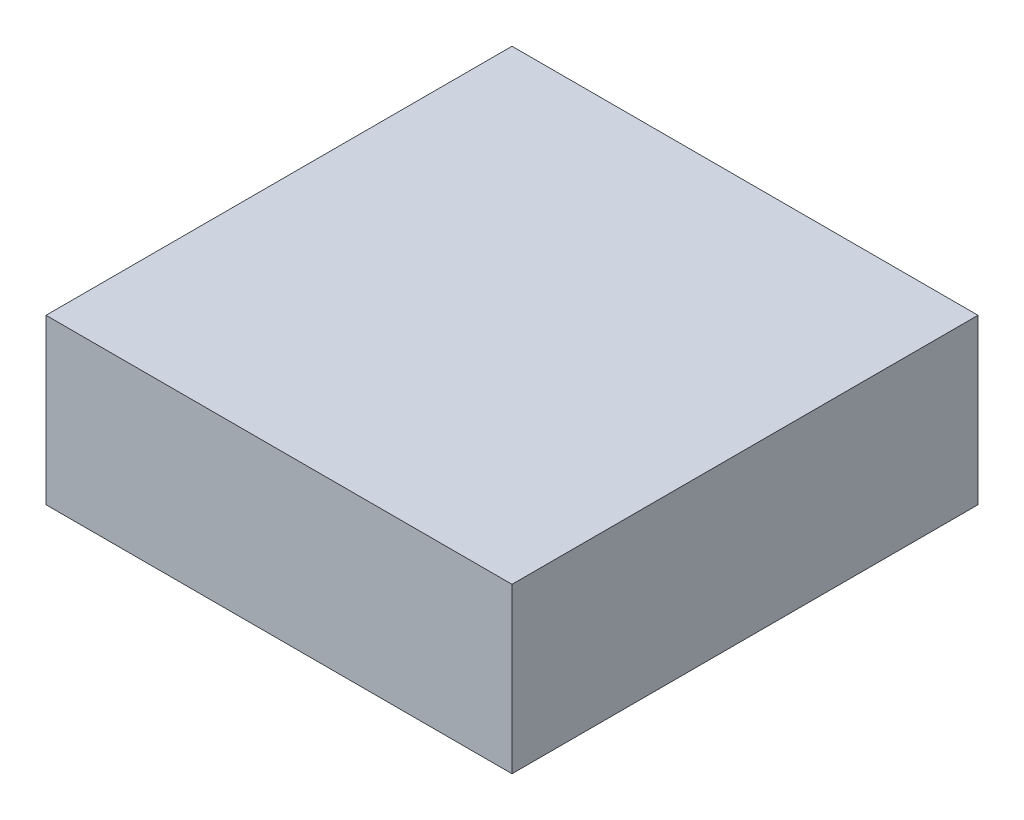
ISO-10303-21;
HEADER;
FILE_DESCRIPTION(('STEP AP214'),'2;1');
FILE_NAME('part.step','',(''),(''),'','','');
FILE_SCHEMA(('AUTOMOTIVE_DESIGN { 1 0 10303 214 1 1 1 1 }'));
ENDSEC;
DATA;
#1=APPLICATION_CONTEXT('core data for automotive mechanical design processes');
#2=APPLICATION_PROTOCOL_DEFINITION('international standard','automotive_design',2000,#1);
#3=PRODUCT_CONTEXT('',#1,'mechanical');
#4=PRODUCT('Part','Part','',(#3));
#5=PRODUCT_RELATED_PRODUCT_CATEGORY('part','',(#4));
#6=PRODUCT_DEFINITION_FORMATION('','',#4);
#7=PRODUCT_DEFINITION_CONTEXT('part definition',#1,'design');
#8=PRODUCT_DEFINITION('design','',#6,#7);
#9=PRODUCT_DEFINITION_SHAPE('','',#8);
#10=(LENGTH_UNIT() NAMED_UNIT(*) SI_UNIT(.MILLI.,.METRE.));
#11=(NAMED_UNIT(*) PLANE_ANGLE_UNIT() SI_UNIT($,.RADIAN.));
#12=(NAMED_UNIT(*) SI_UNIT($,.STERADIAN.) SOLID_ANGLE_UNIT());
#13=UNCERTAINTY_MEASURE_WITH_UNIT(LENGTH_MEASURE(1.E-05),#10,'distance_accuracy_value','');
#14=(GEOMETRIC_REPRESENTATION_CONTEXT(3) GLOBAL_UNCERTAINTY_ASSIGNED_CONTEXT((#13)) GLOBAL_UNIT_ASSIGNED_CONTEXT((#10,
#11,#12)) REPRESENTATION_CONTEXT('',''));
#15=CARTESIAN_POINT('',(0.,0.,0.));
#16=DIRECTION('',(0.,0.,1.));
#17=DIRECTION('',(1.,0.,0.));
#18=AXIS2_PLACEMENT_3D('',#15,#16,#17);
#19=CARTESIAN_POINT('',(14.2,10.,-14.2));
#20=DIRECTION('',(-1.,0.,0.));
#21=DIRECTION('',(0.,0.,1.));
#22=AXIS2_PLACEMENT_3D('',#19,#20,#21);
#23=PLANE('',#22);
#24=DIRECTION('',(0.,0.,-1.));
#25=VECTOR('',#24,1.);
#26=CARTESIAN_POINT('',(14.2,0.,-14.2));
#27=LINE('',#26,#25);
#28=CARTESIAN_POINT('',(14.2,0.,14.2));
#29=VERTEX_POINT('',#28);
#30=CARTESIAN_POINT('',(14.2,0.,-14.2));
#31=VERTEX_POINT('',#30);
#32=EDGE_CURVE('E96',#29,#31,#27,.T.);
#33=ORIENTED_EDGE('',*,*,#32,.T.);
#34=DIRECTION('',(0.,-1.,0.));
#35=VECTOR('',#34,1.);
#36=CARTESIAN_POINT('',(14.2,10.,-14.2));
#37=LINE('',#36,#35);
#38=CARTESIAN_POINT('',(14.2,10.,-14.2));
#39=VERTEX_POINT('',#38);
#40=EDGE_CURVE('E11',#39,#31,#37,.T.);
#41=ORIENTED_EDGE('',*,*,#40,.F.);
#42=DIRECTION('',(0.,0.,-1.));
#43=VECTOR('',#42,1.);
#44=CARTESIAN_POINT('',(14.2,10.,-14.2));
#45=LINE('',#44,#43);
#46=CARTESIAN_POINT('',(14.2,10.,14.2));
#47=VERTEX_POINT('',#46);
#48=EDGE_CURVE('E84',#47,#39,#45,.T.);
#49=ORIENTED_EDGE('',*,*,#48,.F.);
#50=DIRECTION('',(0.,-1.,0.));
#51=VECTOR('',#50,1.);
#52=CARTESIAN_POINT('',(14.2,10.,14.2));
#53=LINE('',#52,#51);
#54=EDGE_CURVE('E92',#47,#29,#53,.T.);
#55=ORIENTED_EDGE('',*,*,#54,.T.);
#56=EDGE_LOOP('',(#33,#41,#49,#55));
#57=FACE_BOUND('',#56,.T.);
#58=ADVANCED_FACE('F33',(#57),#23,.F.);
#59=CARTESIAN_POINT('',(-14.2,10.,-14.2));
#60=DIRECTION('',(0.,0.,1.));
#61=DIRECTION('',(1.,0.,0.));
#62=AXIS2_PLACEMENT_3D('',#59,#60,#61);
#63=PLANE('',#62);
#64=DIRECTION('',(-1.,0.,0.));
#65=VECTOR('',#64,1.);
#66=CARTESIAN_POINT('',(-14.2,0.,-14.2));
#67=LINE('',#66,#65);
#68=CARTESIAN_POINT('',(-14.2,0.,-14.2));
#69=VERTEX_POINT('',#68);
#70=EDGE_CURVE('E88',#31,#69,#67,.T.);
#71=ORIENTED_EDGE('',*,*,#70,.T.);
#72=DIRECTION('',(0.,-1.,0.));
#73=VECTOR('',#72,1.);
#74=CARTESIAN_POINT('',(-14.2,10.,-14.2));
#75=LINE('',#74,#73);
#76=CARTESIAN_POINT('',(-14.2,10.,-14.2));
#77=VERTEX_POINT('',#76);
#78=EDGE_CURVE('E41',#77,#69,#75,.T.);
#79=ORIENTED_EDGE('',*,*,#78,.F.);
#80=DIRECTION('',(-1.,0.,0.));
#81=VECTOR('',#80,1.);
#82=CARTESIAN_POINT('',(-14.2,10.,-14.2));
#83=LINE('',#82,#81);
#84=EDGE_CURVE('E79',#39,#77,#83,.T.);
#85=ORIENTED_EDGE('',*,*,#84,.F.);
#86=ORIENTED_EDGE('',*,*,#40,.T.);
#87=EDGE_LOOP('',(#71,#79,#85,#86));
#88=FACE_BOUND('',#87,.T.);
#89=ADVANCED_FACE('F87',(#88),#63,.F.);
#90=CARTESIAN_POINT('',(-14.2,10.,-14.2));
#91=DIRECTION('',(1.,0.,0.));
#92=DIRECTION('',(0.,0.,-1.));
#93=AXIS2_PLACEMENT_3D('',#90,#91,#92);
#94=PLANE('',#93);
#95=DIRECTION('',(0.,0.,1.));
#96=VECTOR('',#95,1.);
#97=CARTESIAN_POINT('',(-14.2,0.,-14.2));
#98=LINE('',#97,#96);
#99=CARTESIAN_POINT('',(-14.2,0.,14.2));
#100=VERTEX_POINT('',#99);
#101=EDGE_CURVE('E66',#69,#100,#98,.T.);
#102=ORIENTED_EDGE('',*,*,#101,.T.);
#103=DIRECTION('',(0.,-1.,0.));
#104=VECTOR('',#103,1.);
#105=CARTESIAN_POINT('',(-14.2,10.,14.2));
#106=LINE('',#105,#104);
#107=CARTESIAN_POINT('',(-14.2,10.,14.2));
#108=VERTEX_POINT('',#107);
#109=EDGE_CURVE('E89',#108,#100,#106,.T.);
#110=ORIENTED_EDGE('',*,*,#109,.F.);
#111=DIRECTION('',(0.,0.,1.));
#112=VECTOR('',#111,1.);
#113=CARTESIAN_POINT('',(-14.2,10.,-14.2));
#114=LINE('',#113,#112);
#115=EDGE_CURVE('E82',#77,#108,#114,.T.);
#116=ORIENTED_EDGE('',*,*,#115,.F.);
#117=ORIENTED_EDGE('',*,*,#78,.T.);
#118=EDGE_LOOP('',(#102,#110,#116,#117));
#119=FACE_BOUND('',#118,.T.);
#120=ADVANCED_FACE('F90',(#119),#94,.F.);
#121=CARTESIAN_POINT('',(-14.2,10.,14.2));
#122=DIRECTION('',(0.,0.,-1.));
#123=DIRECTION('',(-1.,0.,0.));
#124=AXIS2_PLACEMENT_3D('',#121,#122,#123);
#125=PLANE('',#124);
#126=DIRECTION('',(1.,0.,0.));
#127=VECTOR('',#126,1.);
#128=CARTESIAN_POINT('',(-14.2,0.,14.2));
#129=LINE('',#128,#127);
#130=EDGE_CURVE('E72',#100,#29,#129,.T.);
#131=ORIENTED_EDGE('',*,*,#130,.T.);
#132=ORIENTED_EDGE('',*,*,#54,.F.);
#133=DIRECTION('',(1.,0.,0.));
#134=VECTOR('',#133,1.);
#135=CARTESIAN_POINT('',(-14.2,10.,14.2));
#136=LINE('',#135,#134);
#137=EDGE_CURVE('E49',#108,#47,#136,.T.);
#138=ORIENTED_EDGE('',*,*,#137,.F.);
#139=ORIENTED_EDGE('',*,*,#109,.T.);
#140=EDGE_LOOP('',(#131,#132,#138,#139));
#141=FACE_BOUND('',#140,.T.);
#142=ADVANCED_FACE('F103',(#141),#125,.F.);
#143=CARTESIAN_POINT('',(0.,10.,0.));
#144=DIRECTION('',(0.,1.,0.));
#145=DIRECTION('',(0.,0.,1.));
#146=AXIS2_PLACEMENT_3D('',#143,#144,#145);
#147=PLANE('',#146);
#148=ORIENTED_EDGE('',*,*,#48,.T.);
#149=ORIENTED_EDGE('',*,*,#84,.T.);
#150=ORIENTED_EDGE('',*,*,#115,.T.);
#151=ORIENTED_EDGE('',*,*,#137,.T.);
#152=EDGE_LOOP('',(#148,#149,#150,#151));
#153=FACE_BOUND('',#152,.T.);
#154=ADVANCED_FACE('F80',(#153),#147,.T.);
#155=CARTESIAN_POINT('',(0.,0.,0.));
#156=DIRECTION('',(0.,1.,0.));
#157=DIRECTION('',(0.,0.,1.));
#158=AXIS2_PLACEMENT_3D('',#155,#156,#157);
#159=PLANE('',#158);
#160=ORIENTED_EDGE('',*,*,#32,.F.);
#161=ORIENTED_EDGE('',*,*,#130,.F.);
#162=ORIENTED_EDGE('',*,*,#101,.F.);
#163=ORIENTED_EDGE('',*,*,#70,.F.);
#164=EDGE_LOOP('',(#160,#161,#162,#163));
#165=FACE_BOUND('',#164,.T.);
#166=ADVANCED_FACE('F106',(#165),#159,.F.);
#167=CLOSED_SHELL('',(#58,#89,#120,#142,#154,#166));
#168=MANIFOLD_SOLID_BREP('B2',#167);
#169=ADVANCED_BREP_SHAPE_REPRESENTATION('',(#18,#168),#14);
#170=SHAPE_DEFINITION_REPRESENTATION(#9,#169);
ENDSEC;
END-ISO-10303-21;
